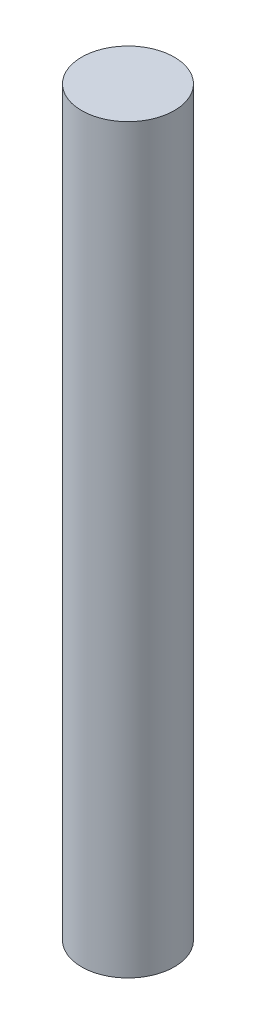
ISO-10303-21;
HEADER;
FILE_DESCRIPTION(('STEP AP214'),'2;1');
FILE_NAME('part.step','',(''),(''),'','','');
FILE_SCHEMA(('AUTOMOTIVE_DESIGN { 1 0 10303 214 1 1 1 1 }'));
ENDSEC;
DATA;
#1=APPLICATION_CONTEXT('core data for automotive mechanical design processes');
#2=APPLICATION_PROTOCOL_DEFINITION('international standard','automotive_design',2000,#1);
#3=PRODUCT_CONTEXT('',#1,'mechanical');
#4=PRODUCT('Part','Part','',(#3));
#5=PRODUCT_RELATED_PRODUCT_CATEGORY('part','',(#4));
#6=PRODUCT_DEFINITION_FORMATION('','',#4);
#7=PRODUCT_DEFINITION_CONTEXT('part definition',#1,'design');
#8=PRODUCT_DEFINITION('design','',#6,#7);
#9=PRODUCT_DEFINITION_SHAPE('','',#8);
#10=(LENGTH_UNIT() NAMED_UNIT(*) SI_UNIT(.MILLI.,.METRE.));
#11=(NAMED_UNIT(*) PLANE_ANGLE_UNIT() SI_UNIT($,.RADIAN.));
#12=(NAMED_UNIT(*) SI_UNIT($,.STERADIAN.) SOLID_ANGLE_UNIT());
#13=UNCERTAINTY_MEASURE_WITH_UNIT(LENGTH_MEASURE(1.E-05),#10,'distance_accuracy_value','');
#14=(GEOMETRIC_REPRESENTATION_CONTEXT(3) GLOBAL_UNCERTAINTY_ASSIGNED_CONTEXT((#13)) GLOBAL_UNIT_ASSIGNED_CONTEXT((#10,
#11,#12)) REPRESENTATION_CONTEXT('',''));
#15=CARTESIAN_POINT('',(0.,0.,0.));
#16=DIRECTION('',(0.,0.,1.));
#17=DIRECTION('',(1.,0.,0.));
#18=AXIS2_PLACEMENT_3D('',#15,#16,#17);
#19=CARTESIAN_POINT('',(0.,-25.4,0.));
#20=DIRECTION('',(0.,1.,0.));
#21=DIRECTION('',(0.,0.,1.));
#22=AXIS2_PLACEMENT_3D('',#19,#20,#21);
#23=CYLINDRICAL_SURFACE('',#22,1.5875);
#24=CARTESIAN_POINT('',(0.,-25.4,0.));
#25=DIRECTION('',(0.,1.,0.));
#26=DIRECTION('',(0.,0.,1.));
#27=AXIS2_PLACEMENT_3D('',#24,#25,#26);
#28=CIRCLE('',#27,1.5875);
#29=CARTESIAN_POINT('',(0.,-25.4,1.5875));
#30=VERTEX_POINT('',#29);
#31=EDGE_CURVE('E10',#30,#30,#28,.T.);
#32=ORIENTED_EDGE('',*,*,#31,.T.);
#33=EDGE_LOOP('',(#32));
#34=FACE_BOUND('',#33,.T.);
#35=CARTESIAN_POINT('',(0.,0.,0.));
#36=DIRECTION('',(0.,1.,0.));
#37=DIRECTION('',(0.,0.,1.));
#38=AXIS2_PLACEMENT_3D('',#35,#36,#37);
#39=CIRCLE('',#38,1.5875);
#40=CARTESIAN_POINT('',(0.,0.,1.5875));
#41=VERTEX_POINT('',#40);
#42=EDGE_CURVE('E34',#41,#41,#39,.T.);
#43=ORIENTED_EDGE('',*,*,#42,.F.);
#44=EDGE_LOOP('',(#43));
#45=FACE_BOUND('',#44,.T.);
#46=ADVANCED_FACE('F31',(#34,#45),#23,.T.);
#47=CARTESIAN_POINT('',(0.,-25.4,0.));
#48=DIRECTION('',(0.,1.,0.));
#49=DIRECTION('',(0.,0.,1.));
#50=AXIS2_PLACEMENT_3D('',#47,#48,#49);
#51=PLANE('',#50);
#52=ORIENTED_EDGE('',*,*,#31,.F.);
#53=EDGE_LOOP('',(#52));
#54=FACE_BOUND('',#53,.T.);
#55=ADVANCED_FACE('F46',(#54),#51,.F.);
#56=CARTESIAN_POINT('',(0.,0.,0.));
#57=DIRECTION('',(0.,1.,0.));
#58=DIRECTION('',(0.,0.,1.));
#59=AXIS2_PLACEMENT_3D('',#56,#57,#58);
#60=PLANE('',#59);
#61=ORIENTED_EDGE('',*,*,#42,.T.);
#62=EDGE_LOOP('',(#61));
#63=FACE_BOUND('',#62,.T.);
#64=ADVANCED_FACE('F43',(#63),#60,.T.);
#65=CLOSED_SHELL('',(#46,#55,#64));
#66=MANIFOLD_SOLID_BREP('B2',#65);
#67=ADVANCED_BREP_SHAPE_REPRESENTATION('',(#18,#66),#14);
#68=SHAPE_DEFINITION_REPRESENTATION(#9,#67);
ENDSEC;
END-ISO-10303-21;
